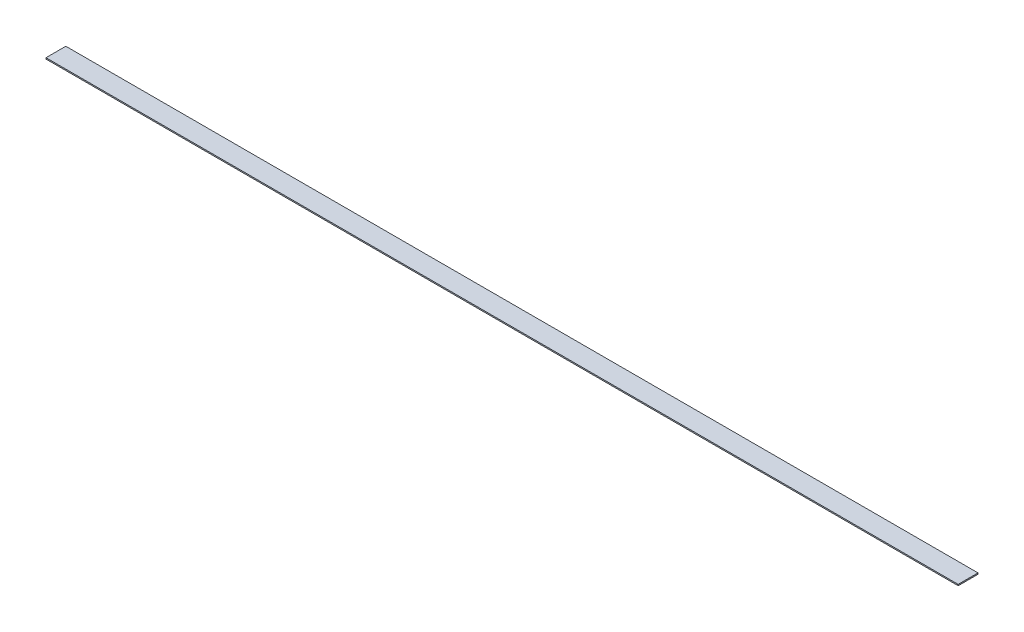
ISO-10303-21;
HEADER;
FILE_DESCRIPTION(('STEP AP214'),'2;1');
FILE_NAME('part.step','',(''),(''),'','','');
FILE_SCHEMA(('AUTOMOTIVE_DESIGN { 1 0 10303 214 1 1 1 1 }'));
ENDSEC;
DATA;
#1=APPLICATION_CONTEXT('core data for automotive mechanical design processes');
#2=APPLICATION_PROTOCOL_DEFINITION('international standard','automotive_design',2000,#1);
#3=PRODUCT_CONTEXT('',#1,'mechanical');
#4=PRODUCT('Part','Part','',(#3));
#5=PRODUCT_RELATED_PRODUCT_CATEGORY('part','',(#4));
#6=PRODUCT_DEFINITION_FORMATION('','',#4);
#7=PRODUCT_DEFINITION_CONTEXT('part definition',#1,'design');
#8=PRODUCT_DEFINITION('design','',#6,#7);
#9=PRODUCT_DEFINITION_SHAPE('','',#8);
#10=(LENGTH_UNIT() NAMED_UNIT(*) SI_UNIT(.MILLI.,.METRE.));
#11=(NAMED_UNIT(*) PLANE_ANGLE_UNIT() SI_UNIT($,.RADIAN.));
#12=(NAMED_UNIT(*) SI_UNIT($,.STERADIAN.) SOLID_ANGLE_UNIT());
#13=UNCERTAINTY_MEASURE_WITH_UNIT(LENGTH_MEASURE(1.E-05),#10,'distance_accuracy_value','');
#14=(GEOMETRIC_REPRESENTATION_CONTEXT(3) GLOBAL_UNCERTAINTY_ASSIGNED_CONTEXT((#13)) GLOBAL_UNIT_ASSIGNED_CONTEXT((#10,
#11,#12)) REPRESENTATION_CONTEXT('',''));
#15=CARTESIAN_POINT('',(0.,0.,0.));
#16=DIRECTION('',(0.,0.,1.));
#17=DIRECTION('',(1.,0.,0.));
#18=AXIS2_PLACEMENT_3D('',#15,#16,#17);
#19=CARTESIAN_POINT('',(-584.200000000001,1.5875,12.7));
#20=DIRECTION('',(1.,0.,0.));
#21=DIRECTION('',(0.,0.,-1.));
#22=AXIS2_PLACEMENT_3D('',#19,#20,#21);
#23=PLANE('',#22);
#24=DIRECTION('',(0.,0.,1.));
#25=VECTOR('',#24,1.);
#26=CARTESIAN_POINT('',(-584.200000000001,0.,12.7));
#27=LINE('',#26,#25);
#28=CARTESIAN_POINT('',(-584.200000000001,0.,-12.6999999999999));
#29=VERTEX_POINT('',#28);
#30=CARTESIAN_POINT('',(-584.200000000001,0.,12.7));
#31=VERTEX_POINT('',#30);
#32=EDGE_CURVE('E100',#29,#31,#27,.T.);
#33=ORIENTED_EDGE('',*,*,#32,.T.);
#34=DIRECTION('',(0.,-1.,0.));
#35=VECTOR('',#34,1.);
#36=CARTESIAN_POINT('',(-584.200000000001,1.5875,12.7));
#37=LINE('',#36,#35);
#38=CARTESIAN_POINT('',(-584.200000000001,1.5875,12.7));
#39=VERTEX_POINT('',#38);
#40=EDGE_CURVE('E11',#39,#31,#37,.T.);
#41=ORIENTED_EDGE('',*,*,#40,.F.);
#42=DIRECTION('',(0.,0.,1.));
#43=VECTOR('',#42,1.);
#44=CARTESIAN_POINT('',(-584.200000000001,1.5875,12.7));
#45=LINE('',#44,#43);
#46=CARTESIAN_POINT('',(-584.200000000001,1.5875,-12.6999999999999));
#47=VERTEX_POINT('',#46);
#48=EDGE_CURVE('E88',#47,#39,#45,.T.);
#49=ORIENTED_EDGE('',*,*,#48,.F.);
#50=DIRECTION('',(0.,-1.,0.));
#51=VECTOR('',#50,1.);
#52=CARTESIAN_POINT('',(-584.200000000001,1.5875,-12.6999999999999));
#53=LINE('',#52,#51);
#54=EDGE_CURVE('E96',#47,#29,#53,.T.);
#55=ORIENTED_EDGE('',*,*,#54,.T.);
#56=EDGE_LOOP('',(#33,#41,#49,#55));
#57=FACE_BOUND('',#56,.T.);
#58=ADVANCED_FACE('F37',(#57),#23,.F.);
#59=CARTESIAN_POINT('',(584.199999999999,1.5875,12.6999999999999));
#60=DIRECTION('',(0.,0.,-1.));
#61=DIRECTION('',(-1.,0.,0.));
#62=AXIS2_PLACEMENT_3D('',#59,#60,#61);
#63=PLANE('',#62);
#64=DIRECTION('',(1.,0.,0.));
#65=VECTOR('',#64,1.);
#66=CARTESIAN_POINT('',(584.199999999999,0.,12.6999999999999));
#67=LINE('',#66,#65);
#68=CARTESIAN_POINT('',(584.199999999999,0.,12.6999999999999));
#69=VERTEX_POINT('',#68);
#70=EDGE_CURVE('E92',#31,#69,#67,.T.);
#71=ORIENTED_EDGE('',*,*,#70,.T.);
#72=DIRECTION('',(0.,-1.,0.));
#73=VECTOR('',#72,1.);
#74=CARTESIAN_POINT('',(584.199999999999,1.5875,12.6999999999999));
#75=LINE('',#74,#73);
#76=CARTESIAN_POINT('',(584.199999999999,1.5875,12.6999999999999));
#77=VERTEX_POINT('',#76);
#78=EDGE_CURVE('E45',#77,#69,#75,.T.);
#79=ORIENTED_EDGE('',*,*,#78,.F.);
#80=DIRECTION('',(1.,0.,0.));
#81=VECTOR('',#80,1.);
#82=CARTESIAN_POINT('',(584.199999999999,1.5875,12.6999999999999));
#83=LINE('',#82,#81);
#84=EDGE_CURVE('E83',#39,#77,#83,.T.);
#85=ORIENTED_EDGE('',*,*,#84,.F.);
#86=ORIENTED_EDGE('',*,*,#40,.T.);
#87=EDGE_LOOP('',(#71,#79,#85,#86));
#88=FACE_BOUND('',#87,.T.);
#89=ADVANCED_FACE('F91',(#88),#63,.F.);
#90=CARTESIAN_POINT('',(584.199999999999,1.5875,12.6999999999999));
#91=DIRECTION('',(-1.,0.,0.));
#92=DIRECTION('',(0.,0.,1.));
#93=AXIS2_PLACEMENT_3D('',#90,#91,#92);
#94=PLANE('',#93);
#95=DIRECTION('',(0.,0.,-1.));
#96=VECTOR('',#95,1.);
#97=CARTESIAN_POINT('',(584.199999999999,0.,12.6999999999999));
#98=LINE('',#97,#96);
#99=CARTESIAN_POINT('',(584.199999999998,0.,-12.7000000000001));
#100=VERTEX_POINT('',#99);
#101=EDGE_CURVE('E70',#69,#100,#98,.T.);
#102=ORIENTED_EDGE('',*,*,#101,.T.);
#103=DIRECTION('',(0.,-1.,0.));
#104=VECTOR('',#103,1.);
#105=CARTESIAN_POINT('',(584.199999999998,1.5875,-12.7000000000001));
#106=LINE('',#105,#104);
#107=CARTESIAN_POINT('',(584.199999999998,1.5875,-12.7000000000001));
#108=VERTEX_POINT('',#107);
#109=EDGE_CURVE('E93',#108,#100,#106,.T.);
#110=ORIENTED_EDGE('',*,*,#109,.F.);
#111=DIRECTION('',(0.,0.,-1.));
#112=VECTOR('',#111,1.);
#113=CARTESIAN_POINT('',(584.199999999999,1.5875,12.6999999999999));
#114=LINE('',#113,#112);
#115=EDGE_CURVE('E86',#77,#108,#114,.T.);
#116=ORIENTED_EDGE('',*,*,#115,.F.);
#117=ORIENTED_EDGE('',*,*,#78,.T.);
#118=EDGE_LOOP('',(#102,#110,#116,#117));
#119=FACE_BOUND('',#118,.T.);
#120=ADVANCED_FACE('F94',(#119),#94,.F.);
#121=CARTESIAN_POINT('',(584.199999999998,1.5875,-12.7000000000001));
#122=DIRECTION('',(0.,0.,1.));
#123=DIRECTION('',(1.,0.,0.));
#124=AXIS2_PLACEMENT_3D('',#121,#122,#123);
#125=PLANE('',#124);
#126=DIRECTION('',(-1.,0.,0.));
#127=VECTOR('',#126,1.);
#128=CARTESIAN_POINT('',(584.199999999998,0.,-12.7000000000001));
#129=LINE('',#128,#127);
#130=EDGE_CURVE('E76',#100,#29,#129,.T.);
#131=ORIENTED_EDGE('',*,*,#130,.T.);
#132=ORIENTED_EDGE('',*,*,#54,.F.);
#133=DIRECTION('',(-1.,0.,0.));
#134=VECTOR('',#133,1.);
#135=CARTESIAN_POINT('',(584.199999999998,1.5875,-12.7000000000001));
#136=LINE('',#135,#134);
#137=EDGE_CURVE('E53',#108,#47,#136,.T.);
#138=ORIENTED_EDGE('',*,*,#137,.F.);
#139=ORIENTED_EDGE('',*,*,#109,.T.);
#140=EDGE_LOOP('',(#131,#132,#138,#139));
#141=FACE_BOUND('',#140,.T.);
#142=ADVANCED_FACE('F107',(#141),#125,.F.);
#143=CARTESIAN_POINT('',(0.,1.5875,0.));
#144=DIRECTION('',(0.,1.,0.));
#145=DIRECTION('',(0.,0.,1.));
#146=AXIS2_PLACEMENT_3D('',#143,#144,#145);
#147=PLANE('',#146);
#148=ORIENTED_EDGE('',*,*,#48,.T.);
#149=ORIENTED_EDGE('',*,*,#84,.T.);
#150=ORIENTED_EDGE('',*,*,#115,.T.);
#151=ORIENTED_EDGE('',*,*,#137,.T.);
#152=EDGE_LOOP('',(#148,#149,#150,#151));
#153=FACE_BOUND('',#152,.T.);
#154=ADVANCED_FACE('F84',(#153),#147,.T.);
#155=CARTESIAN_POINT('',(0.,0.,0.));
#156=DIRECTION('',(0.,1.,0.));
#157=DIRECTION('',(0.,0.,1.));
#158=AXIS2_PLACEMENT_3D('',#155,#156,#157);
#159=PLANE('',#158);
#160=ORIENTED_EDGE('',*,*,#32,.F.);
#161=ORIENTED_EDGE('',*,*,#130,.F.);
#162=ORIENTED_EDGE('',*,*,#101,.F.);
#163=ORIENTED_EDGE('',*,*,#70,.F.);
#164=EDGE_LOOP('',(#160,#161,#162,#163));
#165=FACE_BOUND('',#164,.T.);
#166=ADVANCED_FACE('F110',(#165),#159,.F.);
#167=CLOSED_SHELL('',(#58,#89,#120,#142,#154,#166));
#168=MANIFOLD_SOLID_BREP('B2',#167);
#169=ADVANCED_BREP_SHAPE_REPRESENTATION('',(#18,#168),#14);
#170=SHAPE_DEFINITION_REPRESENTATION(#9,#169);
ENDSEC;
END-ISO-10303-21;
